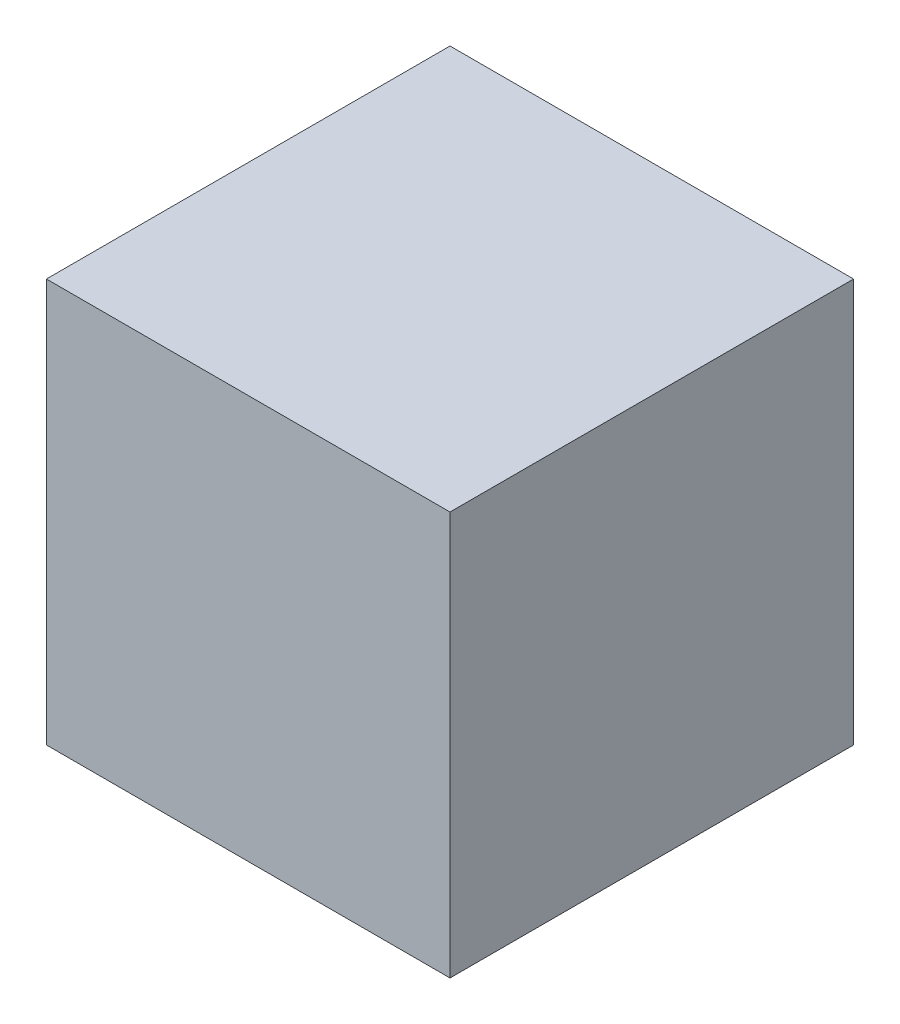
ISO-10303-21;
HEADER;
FILE_DESCRIPTION(('STEP AP214'),'2;1');
FILE_NAME('part.step','',(''),(''),'','','');
FILE_SCHEMA(('AUTOMOTIVE_DESIGN { 1 0 10303 214 1 1 1 1 }'));
ENDSEC;
DATA;
#1=APPLICATION_CONTEXT('core data for automotive mechanical design processes');
#2=APPLICATION_PROTOCOL_DEFINITION('international standard','automotive_design',2000,#1);
#3=PRODUCT_CONTEXT('',#1,'mechanical');
#4=PRODUCT('Part','Part','',(#3));
#5=PRODUCT_RELATED_PRODUCT_CATEGORY('part','',(#4));
#6=PRODUCT_DEFINITION_FORMATION('','',#4);
#7=PRODUCT_DEFINITION_CONTEXT('part definition',#1,'design');
#8=PRODUCT_DEFINITION('design','',#6,#7);
#9=PRODUCT_DEFINITION_SHAPE('','',#8);
#10=(LENGTH_UNIT() NAMED_UNIT(*) SI_UNIT(.MILLI.,.METRE.));
#11=(NAMED_UNIT(*) PLANE_ANGLE_UNIT() SI_UNIT($,.RADIAN.));
#12=(NAMED_UNIT(*) SI_UNIT($,.STERADIAN.) SOLID_ANGLE_UNIT());
#13=UNCERTAINTY_MEASURE_WITH_UNIT(LENGTH_MEASURE(1.E-05),#10,'distance_accuracy_value','');
#14=(GEOMETRIC_REPRESENTATION_CONTEXT(3) GLOBAL_UNCERTAINTY_ASSIGNED_CONTEXT((#13)) GLOBAL_UNIT_ASSIGNED_CONTEXT((#10,
#11,#12)) REPRESENTATION_CONTEXT('',''));
#15=CARTESIAN_POINT('',(0.,0.,0.));
#16=DIRECTION('',(0.,0.,1.));
#17=DIRECTION('',(1.,0.,0.));
#18=AXIS2_PLACEMENT_3D('',#15,#16,#17);
#19=CARTESIAN_POINT('',(-0.500000000000001,-0.500000000000001,0.));
#20=DIRECTION('',(0.,0.,1.));
#21=DIRECTION('',(1.,0.,0.));
#22=AXIS2_PLACEMENT_3D('',#19,#20,#21);
#23=PLANE('',#22);
#24=DIRECTION('',(1.,0.,0.));
#25=VECTOR('',#24,1.);
#26=CARTESIAN_POINT('',(-0.500000000000001,0.500000000000001,0.));
#27=LINE('',#26,#25);
#28=CARTESIAN_POINT('',(-0.500000000000001,0.500000000000001,0.));
#29=VERTEX_POINT('',#28);
#30=CARTESIAN_POINT('',(0.500000000000001,0.500000000000001,0.));
#31=VERTEX_POINT('',#30);
#32=EDGE_CURVE('E80',#29,#31,#27,.T.);
#33=ORIENTED_EDGE('',*,*,#32,.T.);
#34=DIRECTION('',(0.,1.,0.));
#35=VECTOR('',#34,1.);
#36=CARTESIAN_POINT('',(0.500000000000001,0.500000000000001,0.));
#37=LINE('',#36,#35);
#38=CARTESIAN_POINT('',(0.500000000000001,-0.500000000000001,0.));
#39=VERTEX_POINT('',#38);
#40=EDGE_CURVE('E67',#31,#39,#37,.F.);
#41=ORIENTED_EDGE('',*,*,#40,.T.);
#42=DIRECTION('',(1.,0.,0.));
#43=VECTOR('',#42,1.);
#44=CARTESIAN_POINT('',(-0.500000000000001,-0.500000000000001,0.));
#45=LINE('',#44,#43);
#46=CARTESIAN_POINT('',(-0.500000000000001,-0.500000000000001,0.));
#47=VERTEX_POINT('',#46);
#48=EDGE_CURVE('E54',#39,#47,#45,.F.);
#49=ORIENTED_EDGE('',*,*,#48,.T.);
#50=DIRECTION('',(0.,1.,0.));
#51=VECTOR('',#50,1.);
#52=CARTESIAN_POINT('',(-0.500000000000001,0.500000000000001,0.));
#53=LINE('',#52,#51);
#54=EDGE_CURVE('E19',#47,#29,#53,.T.);
#55=ORIENTED_EDGE('',*,*,#54,.T.);
#56=EDGE_LOOP('',(#33,#41,#49,#55));
#57=FACE_BOUND('',#56,.T.);
#58=ADVANCED_FACE('F16',(#57),#23,.F.);
#59=CARTESIAN_POINT('',(-0.500000000000001,0.500000000000001,1.));
#60=DIRECTION('',(1.,0.,0.));
#61=DIRECTION('',(0.,0.,-1.));
#62=AXIS2_PLACEMENT_3D('',#59,#60,#61);
#63=PLANE('',#62);
#64=DIRECTION('',(0.,0.,1.));
#65=VECTOR('',#64,1.);
#66=CARTESIAN_POINT('',(-0.500000000000001,-0.500000000000001,1.));
#67=LINE('',#66,#65);
#68=CARTESIAN_POINT('',(-0.500000000000001,-0.500000000000001,1.));
#69=VERTEX_POINT('',#68);
#70=EDGE_CURVE('E60',#47,#69,#67,.T.);
#71=ORIENTED_EDGE('',*,*,#70,.T.);
#72=DIRECTION('',(0.,1.,0.));
#73=VECTOR('',#72,1.);
#74=CARTESIAN_POINT('',(-0.500000000000001,-0.500000000000001,1.));
#75=LINE('',#74,#73);
#76=CARTESIAN_POINT('',(-0.500000000000001,0.500000000000001,1.));
#77=VERTEX_POINT('',#76);
#78=EDGE_CURVE('E82',#77,#69,#75,.F.);
#79=ORIENTED_EDGE('',*,*,#78,.F.);
#80=DIRECTION('',(0.,0.,-1.));
#81=VECTOR('',#80,1.);
#82=CARTESIAN_POINT('',(-0.500000000000001,0.500000000000001,1.));
#83=LINE('',#82,#81);
#84=EDGE_CURVE('E63',#77,#29,#83,.T.);
#85=ORIENTED_EDGE('',*,*,#84,.T.);
#86=ORIENTED_EDGE('',*,*,#54,.F.);
#87=EDGE_LOOP('',(#71,#79,#85,#86));
#88=FACE_BOUND('',#87,.T.);
#89=ADVANCED_FACE('F59',(#88),#63,.F.);
#90=CARTESIAN_POINT('',(-0.500000000000001,-0.500000000000001,1.));
#91=DIRECTION('',(0.,1.,0.));
#92=DIRECTION('',(0.,0.,1.));
#93=AXIS2_PLACEMENT_3D('',#90,#91,#92);
#94=PLANE('',#93);
#95=DIRECTION('',(0.,0.,1.));
#96=VECTOR('',#95,1.);
#97=CARTESIAN_POINT('',(0.500000000000001,-0.500000000000001,1.));
#98=LINE('',#97,#96);
#99=CARTESIAN_POINT('',(0.500000000000001,-0.500000000000001,1.));
#100=VERTEX_POINT('',#99);
#101=EDGE_CURVE('E69',#39,#100,#98,.T.);
#102=ORIENTED_EDGE('',*,*,#101,.T.);
#103=DIRECTION('',(1.,0.,0.));
#104=VECTOR('',#103,1.);
#105=CARTESIAN_POINT('',(-0.500000000000001,-0.500000000000001,1.));
#106=LINE('',#105,#104);
#107=EDGE_CURVE('E73',#69,#100,#106,.T.);
#108=ORIENTED_EDGE('',*,*,#107,.F.);
#109=ORIENTED_EDGE('',*,*,#70,.F.);
#110=ORIENTED_EDGE('',*,*,#48,.F.);
#111=EDGE_LOOP('',(#102,#108,#109,#110));
#112=FACE_BOUND('',#111,.T.);
#113=ADVANCED_FACE('F71',(#112),#94,.F.);
#114=CARTESIAN_POINT('',(0.500000000000001,0.500000000000001,1.));
#115=DIRECTION('',(-1.,0.,0.));
#116=DIRECTION('',(0.,0.,1.));
#117=AXIS2_PLACEMENT_3D('',#114,#115,#116);
#118=PLANE('',#117);
#119=DIRECTION('',(0.,0.,-1.));
#120=VECTOR('',#119,1.);
#121=CARTESIAN_POINT('',(0.500000000000001,0.500000000000001,1.));
#122=LINE('',#121,#120);
#123=CARTESIAN_POINT('',(0.500000000000001,0.500000000000001,1.));
#124=VERTEX_POINT('',#123);
#125=EDGE_CURVE('E34',#31,#124,#122,.F.);
#126=ORIENTED_EDGE('',*,*,#125,.T.);
#127=DIRECTION('',(0.,1.,0.));
#128=VECTOR('',#127,1.);
#129=CARTESIAN_POINT('',(0.500000000000001,-0.500000000000001,1.));
#130=LINE('',#129,#128);
#131=EDGE_CURVE('E25',#100,#124,#130,.T.);
#132=ORIENTED_EDGE('',*,*,#131,.F.);
#133=ORIENTED_EDGE('',*,*,#101,.F.);
#134=ORIENTED_EDGE('',*,*,#40,.F.);
#135=EDGE_LOOP('',(#126,#132,#133,#134));
#136=FACE_BOUND('',#135,.T.);
#137=ADVANCED_FACE('F88',(#136),#118,.F.);
#138=CARTESIAN_POINT('',(-0.500000000000001,0.500000000000001,1.));
#139=DIRECTION('',(0.,-1.,0.));
#140=DIRECTION('',(0.,0.,-1.));
#141=AXIS2_PLACEMENT_3D('',#138,#139,#140);
#142=PLANE('',#141);
#143=ORIENTED_EDGE('',*,*,#84,.F.);
#144=DIRECTION('',(1.,0.,0.));
#145=VECTOR('',#144,1.);
#146=CARTESIAN_POINT('',(-0.500000000000001,0.500000000000001,1.));
#147=LINE('',#146,#145);
#148=EDGE_CURVE('E11',#124,#77,#147,.F.);
#149=ORIENTED_EDGE('',*,*,#148,.F.);
#150=ORIENTED_EDGE('',*,*,#125,.F.);
#151=ORIENTED_EDGE('',*,*,#32,.F.);
#152=EDGE_LOOP('',(#143,#149,#150,#151));
#153=FACE_BOUND('',#152,.T.);
#154=ADVANCED_FACE('F90',(#153),#142,.F.);
#155=CARTESIAN_POINT('',(-0.500000000000001,-0.500000000000001,1.));
#156=DIRECTION('',(0.,0.,1.));
#157=DIRECTION('',(1.,0.,0.));
#158=AXIS2_PLACEMENT_3D('',#155,#156,#157);
#159=PLANE('',#158);
#160=ORIENTED_EDGE('',*,*,#131,.T.);
#161=ORIENTED_EDGE('',*,*,#148,.T.);
#162=ORIENTED_EDGE('',*,*,#78,.T.);
#163=ORIENTED_EDGE('',*,*,#107,.T.);
#164=EDGE_LOOP('',(#160,#161,#162,#163));
#165=FACE_BOUND('',#164,.T.);
#166=ADVANCED_FACE('F87',(#165),#159,.T.);
#167=CLOSED_SHELL('',(#58,#89,#113,#137,#154,#166));
#168=MANIFOLD_SOLID_BREP('B1',#167);
#169=ADVANCED_BREP_SHAPE_REPRESENTATION('',(#18,#168),#14);
#170=SHAPE_DEFINITION_REPRESENTATION(#9,#169);
ENDSEC;
END-ISO-10303-21;
